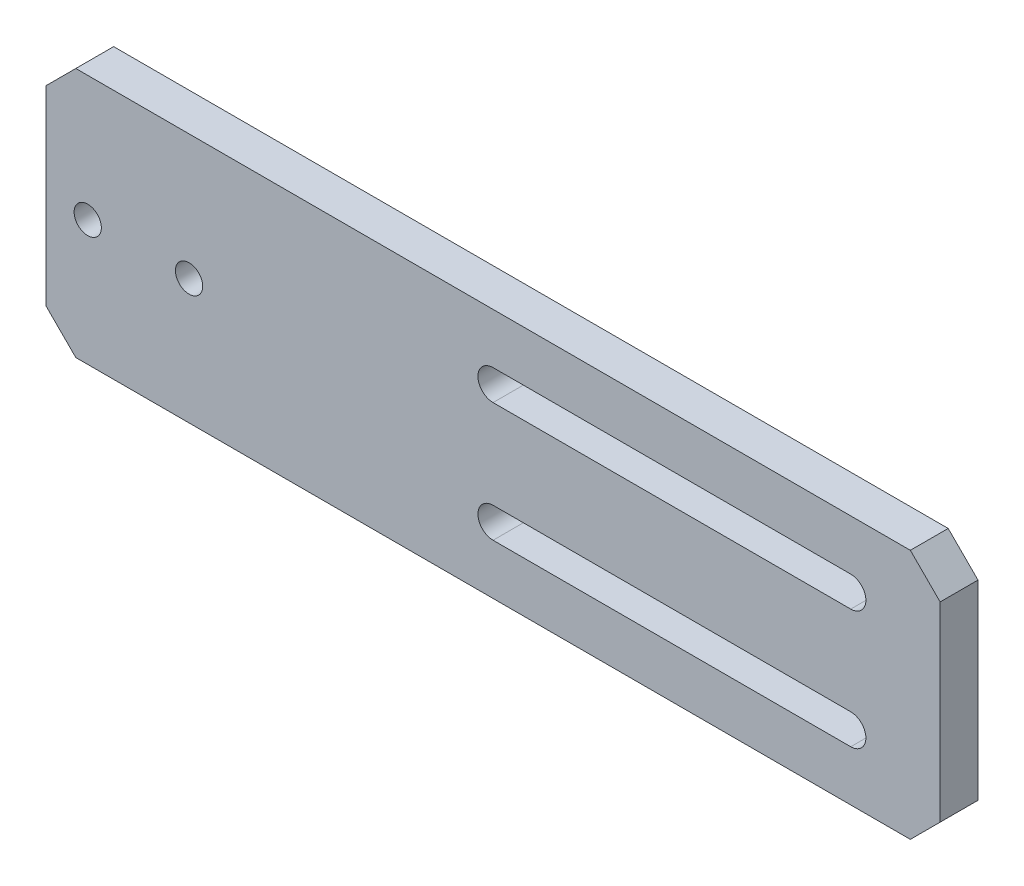
ISO-10303-21;
HEADER;
FILE_DESCRIPTION(('STEP AP214'),'2;1');
FILE_NAME('part.step','',(''),(''),'','','');
FILE_SCHEMA(('AUTOMOTIVE_DESIGN { 1 0 10303 214 1 1 1 1 }'));
ENDSEC;
DATA;
#1=APPLICATION_CONTEXT('core data for automotive mechanical design processes');
#2=APPLICATION_PROTOCOL_DEFINITION('international standard','automotive_design',2000,#1);
#3=PRODUCT_CONTEXT('',#1,'mechanical');
#4=PRODUCT('Part','Part','',(#3));
#5=PRODUCT_RELATED_PRODUCT_CATEGORY('part','',(#4));
#6=PRODUCT_DEFINITION_FORMATION('','',#4);
#7=PRODUCT_DEFINITION_CONTEXT('part definition',#1,'design');
#8=PRODUCT_DEFINITION('design','',#6,#7);
#9=PRODUCT_DEFINITION_SHAPE('','',#8);
#10=(LENGTH_UNIT() NAMED_UNIT(*) SI_UNIT(.MILLI.,.METRE.));
#11=(NAMED_UNIT(*) PLANE_ANGLE_UNIT() SI_UNIT($,.RADIAN.));
#12=(NAMED_UNIT(*) SI_UNIT($,.STERADIAN.) SOLID_ANGLE_UNIT());
#13=UNCERTAINTY_MEASURE_WITH_UNIT(LENGTH_MEASURE(1.E-05),#10,'distance_accuracy_value','');
#14=(GEOMETRIC_REPRESENTATION_CONTEXT(3) GLOBAL_UNCERTAINTY_ASSIGNED_CONTEXT((#13)) GLOBAL_UNIT_ASSIGNED_CONTEXT((#10,
#11,#12)) REPRESENTATION_CONTEXT('',''));
#15=CARTESIAN_POINT('',(0.,0.,0.));
#16=DIRECTION('',(0.,0.,1.));
#17=DIRECTION('',(1.,0.,0.));
#18=AXIS2_PLACEMENT_3D('',#15,#16,#17);
#19=CARTESIAN_POINT('',(0.,0.,6.35));
#20=DIRECTION('',(0.,0.,1.));
#21=DIRECTION('',(1.,0.,0.));
#22=AXIS2_PLACEMENT_3D('',#19,#20,#21);
#23=PLANE('',#22);
#24=DIRECTION('',(0.707106781186547,-0.707106781186548,0.));
#25=VECTOR('',#24,1.);
#26=CARTESIAN_POINT('',(33.,33.,6.35));
#27=LINE('',#26,#25);
#28=CARTESIAN_POINT('',(45.,21.,6.35));
#29=VERTEX_POINT('',#28);
#30=CARTESIAN_POINT('',(50.,16.,6.35));
#31=VERTEX_POINT('',#30);
#32=EDGE_CURVE('E158',#29,#31,#27,.T.);
#33=ORIENTED_EDGE('',*,*,#32,.F.);
#34=DIRECTION('',(-1.,0.,0.));
#35=VECTOR('',#34,1.);
#36=CARTESIAN_POINT('',(-100.,21.,6.35));
#37=LINE('',#36,#35);
#38=CARTESIAN_POINT('',(-95.,21.,6.35));
#39=VERTEX_POINT('',#38);
#40=EDGE_CURVE('E229',#29,#39,#37,.T.);
#41=ORIENTED_EDGE('',*,*,#40,.T.);
#42=DIRECTION('',(0.707106781186549,0.707106781186546,0.));
#43=VECTOR('',#42,1.);
#44=CARTESIAN_POINT('',(-57.9999999999997,58.,6.35));
#45=LINE('',#44,#43);
#46=CARTESIAN_POINT('',(-100.,16.,6.35));
#47=VERTEX_POINT('',#46);
#48=EDGE_CURVE('E257',#39,#47,#45,.F.);
#49=ORIENTED_EDGE('',*,*,#48,.T.);
#50=DIRECTION('',(0.,-1.,0.));
#51=VECTOR('',#50,1.);
#52=CARTESIAN_POINT('',(-100.,21.,6.35));
#53=LINE('',#52,#51);
#54=CARTESIAN_POINT('',(-100.,-16.,6.35));
#55=VERTEX_POINT('',#54);
#56=EDGE_CURVE('E231',#47,#55,#53,.T.);
#57=ORIENTED_EDGE('',*,*,#56,.T.);
#58=DIRECTION('',(-0.707106781186546,0.707106781186549,0.));
#59=VECTOR('',#58,1.);
#60=CARTESIAN_POINT('',(-58.0000000000003,-58.,6.35));
#61=LINE('',#60,#59);
#62=CARTESIAN_POINT('',(-95.,-21.,6.35));
#63=VERTEX_POINT('',#62);
#64=EDGE_CURVE('E255',#55,#63,#61,.F.);
#65=ORIENTED_EDGE('',*,*,#64,.T.);
#66=DIRECTION('',(1.,0.,0.));
#67=VECTOR('',#66,1.);
#68=CARTESIAN_POINT('',(-100.,-21.,6.35));
#69=LINE('',#68,#67);
#70=CARTESIAN_POINT('',(45.,-21.,6.35));
#71=VERTEX_POINT('',#70);
#72=EDGE_CURVE('E173',#63,#71,#69,.T.);
#73=ORIENTED_EDGE('',*,*,#72,.T.);
#74=DIRECTION('',(-0.707106781186547,-0.707106781186548,0.));
#75=VECTOR('',#74,1.);
#76=CARTESIAN_POINT('',(33.,-33.,6.35));
#77=LINE('',#76,#75);
#78=CARTESIAN_POINT('',(50.,-16.,6.35));
#79=VERTEX_POINT('',#78);
#80=EDGE_CURVE('E151',#79,#71,#77,.T.);
#81=ORIENTED_EDGE('',*,*,#80,.F.);
#82=DIRECTION('',(0.,-1.,0.));
#83=VECTOR('',#82,1.);
#84=CARTESIAN_POINT('',(50.,0.,6.35));
#85=LINE('',#84,#83);
#86=EDGE_CURVE('E161',#31,#79,#85,.T.);
#87=ORIENTED_EDGE('',*,*,#86,.F.);
#88=EDGE_LOOP('',(#33,#41,#49,#57,#65,#73,#81,#87));
#89=FACE_BOUND('',#88,.T.);
#90=DIRECTION('',(1.,0.,0.));
#91=VECTOR('',#90,1.);
#92=CARTESIAN_POINT('',(0.,7.46,6.35));
#93=LINE('',#92,#91);
#94=CARTESIAN_POINT('',(-25.,7.46,6.35));
#95=VERTEX_POINT('',#94);
#96=CARTESIAN_POINT('',(35.,7.46,6.35));
#97=VERTEX_POINT('',#96);
#98=EDGE_CURVE('E56',#95,#97,#93,.T.);
#99=ORIENTED_EDGE('',*,*,#98,.F.);
#100=CARTESIAN_POINT('',(-25.,10.,6.35));
#101=DIRECTION('',(0.,0.,1.));
#102=DIRECTION('',(1.,0.,0.));
#103=AXIS2_PLACEMENT_3D('',#100,#101,#102);
#104=CIRCLE('',#103,2.54);
#105=CARTESIAN_POINT('',(-25.,12.54,6.35));
#106=VERTEX_POINT('',#105);
#107=EDGE_CURVE('E207',#106,#95,#104,.T.);
#108=ORIENTED_EDGE('',*,*,#107,.F.);
#109=DIRECTION('',(1.,0.,0.));
#110=VECTOR('',#109,1.);
#111=CARTESIAN_POINT('',(0.,12.54,6.35));
#112=LINE('',#111,#110);
#113=CARTESIAN_POINT('',(35.,12.54,6.35));
#114=VERTEX_POINT('',#113);
#115=EDGE_CURVE('E204',#106,#114,#112,.T.);
#116=ORIENTED_EDGE('',*,*,#115,.T.);
#117=CARTESIAN_POINT('',(35.,10.,6.35));
#118=DIRECTION('',(0.,0.,1.));
#119=DIRECTION('',(1.,0.,0.));
#120=AXIS2_PLACEMENT_3D('',#117,#118,#119);
#121=CIRCLE('',#120,2.54);
#122=EDGE_CURVE('E201',#97,#114,#121,.T.);
#123=ORIENTED_EDGE('',*,*,#122,.F.);
#124=EDGE_LOOP('',(#99,#108,#116,#123));
#125=FACE_BOUND('',#124,.T.);
#126=CARTESIAN_POINT('',(-93.,0.,6.35));
#127=DIRECTION('',(0.,0.,1.));
#128=DIRECTION('',(1.,0.,0.));
#129=AXIS2_PLACEMENT_3D('',#126,#127,#128);
#130=CIRCLE('',#129,2.28599999999999);
#131=CARTESIAN_POINT('',(-90.714,0.,6.35));
#132=VERTEX_POINT('',#131);
#133=EDGE_CURVE('E178',#132,#132,#130,.T.);
#134=ORIENTED_EDGE('',*,*,#133,.F.);
#135=EDGE_LOOP('',(#134));
#136=FACE_BOUND('',#135,.T.);
#137=CARTESIAN_POINT('',(-76.,0.,6.35));
#138=DIRECTION('',(0.,0.,1.));
#139=DIRECTION('',(1.,0.,0.));
#140=AXIS2_PLACEMENT_3D('',#137,#138,#139);
#141=CIRCLE('',#140,2.28599999999999);
#142=CARTESIAN_POINT('',(-73.714,0.,6.35));
#143=VERTEX_POINT('',#142);
#144=EDGE_CURVE('E220',#143,#143,#141,.T.);
#145=ORIENTED_EDGE('',*,*,#144,.F.);
#146=EDGE_LOOP('',(#145));
#147=FACE_BOUND('',#146,.T.);
#148=DIRECTION('',(1.,0.,0.));
#149=VECTOR('',#148,1.);
#150=CARTESIAN_POINT('',(0.,-7.46,6.35));
#151=LINE('',#150,#149);
#152=CARTESIAN_POINT('',(-25.,-7.46,6.35));
#153=VERTEX_POINT('',#152);
#154=CARTESIAN_POINT('',(35.,-7.46,6.35));
#155=VERTEX_POINT('',#154);
#156=EDGE_CURVE('E183',#153,#155,#151,.T.);
#157=ORIENTED_EDGE('',*,*,#156,.T.);
#158=CARTESIAN_POINT('',(35.,-10.,6.35));
#159=DIRECTION('',(0.,0.,1.));
#160=DIRECTION('',(1.,0.,0.));
#161=AXIS2_PLACEMENT_3D('',#158,#159,#160);
#162=CIRCLE('',#161,2.54);
#163=CARTESIAN_POINT('',(35.,-12.54,6.35));
#164=VERTEX_POINT('',#163);
#165=EDGE_CURVE('E48',#155,#164,#162,.F.);
#166=ORIENTED_EDGE('',*,*,#165,.T.);
#167=DIRECTION('',(1.,0.,0.));
#168=VECTOR('',#167,1.);
#169=CARTESIAN_POINT('',(0.,-12.54,6.35));
#170=LINE('',#169,#168);
#171=CARTESIAN_POINT('',(-25.,-12.54,6.35));
#172=VERTEX_POINT('',#171);
#173=EDGE_CURVE('E190',#172,#164,#170,.T.);
#174=ORIENTED_EDGE('',*,*,#173,.F.);
#175=CARTESIAN_POINT('',(-25.,-10.,6.35));
#176=DIRECTION('',(0.,0.,1.));
#177=DIRECTION('',(1.,0.,0.));
#178=AXIS2_PLACEMENT_3D('',#175,#176,#177);
#179=CIRCLE('',#178,2.54);
#180=EDGE_CURVE('E187',#172,#153,#179,.F.);
#181=ORIENTED_EDGE('',*,*,#180,.T.);
#182=EDGE_LOOP('',(#157,#166,#174,#181));
#183=FACE_BOUND('',#182,.T.);
#184=ADVANCED_FACE('F33',(#89,#125,#136,#147,#183),#23,.T.);
#185=CARTESIAN_POINT('',(0.,0.,0.));
#186=DIRECTION('',(0.,0.,1.));
#187=DIRECTION('',(1.,0.,0.));
#188=AXIS2_PLACEMENT_3D('',#185,#186,#187);
#189=PLANE('',#188);
#190=DIRECTION('',(-1.,0.,0.));
#191=VECTOR('',#190,1.);
#192=CARTESIAN_POINT('',(-100.,21.,0.));
#193=LINE('',#192,#191);
#194=CARTESIAN_POINT('',(45.,21.,0.));
#195=VERTEX_POINT('',#194);
#196=CARTESIAN_POINT('',(-95.,21.,0.));
#197=VERTEX_POINT('',#196);
#198=EDGE_CURVE('E226',#195,#197,#193,.T.);
#199=ORIENTED_EDGE('',*,*,#198,.F.);
#200=DIRECTION('',(0.707106781186547,-0.707106781186548,0.));
#201=VECTOR('',#200,1.);
#202=CARTESIAN_POINT('',(33.,33.,0.));
#203=LINE('',#202,#201);
#204=CARTESIAN_POINT('',(50.,16.,0.));
#205=VERTEX_POINT('',#204);
#206=EDGE_CURVE('E11',#195,#205,#203,.T.);
#207=ORIENTED_EDGE('',*,*,#206,.T.);
#208=DIRECTION('',(0.,-1.,0.));
#209=VECTOR('',#208,1.);
#210=CARTESIAN_POINT('',(50.,0.,0.));
#211=LINE('',#210,#209);
#212=CARTESIAN_POINT('',(50.,-16.,0.));
#213=VERTEX_POINT('',#212);
#214=EDGE_CURVE('E41',#205,#213,#211,.T.);
#215=ORIENTED_EDGE('',*,*,#214,.T.);
#216=DIRECTION('',(-0.707106781186547,-0.707106781186548,0.));
#217=VECTOR('',#216,1.);
#218=CARTESIAN_POINT('',(33.,-33.,0.));
#219=LINE('',#218,#217);
#220=CARTESIAN_POINT('',(45.,-21.,0.));
#221=VERTEX_POINT('',#220);
#222=EDGE_CURVE('E154',#213,#221,#219,.T.);
#223=ORIENTED_EDGE('',*,*,#222,.T.);
#224=DIRECTION('',(1.,0.,0.));
#225=VECTOR('',#224,1.);
#226=CARTESIAN_POINT('',(-100.,-21.,0.));
#227=LINE('',#226,#225);
#228=CARTESIAN_POINT('',(-95.,-21.,0.));
#229=VERTEX_POINT('',#228);
#230=EDGE_CURVE('E232',#229,#221,#227,.T.);
#231=ORIENTED_EDGE('',*,*,#230,.F.);
#232=DIRECTION('',(0.707106781186546,-0.707106781186549,0.));
#233=VECTOR('',#232,1.);
#234=CARTESIAN_POINT('',(-95.,-21.,0.));
#235=LINE('',#234,#233);
#236=CARTESIAN_POINT('',(-100.,-16.,0.));
#237=VERTEX_POINT('',#236);
#238=EDGE_CURVE('E247',#229,#237,#235,.F.);
#239=ORIENTED_EDGE('',*,*,#238,.T.);
#240=DIRECTION('',(0.,-1.,0.));
#241=VECTOR('',#240,1.);
#242=CARTESIAN_POINT('',(-100.,21.,0.));
#243=LINE('',#242,#241);
#244=CARTESIAN_POINT('',(-100.,16.,0.));
#245=VERTEX_POINT('',#244);
#246=EDGE_CURVE('E238',#245,#237,#243,.T.);
#247=ORIENTED_EDGE('',*,*,#246,.F.);
#248=DIRECTION('',(-0.707106781186549,-0.707106781186546,0.));
#249=VECTOR('',#248,1.);
#250=CARTESIAN_POINT('',(-100.,16.,0.));
#251=LINE('',#250,#249);
#252=EDGE_CURVE('E249',#245,#197,#251,.F.);
#253=ORIENTED_EDGE('',*,*,#252,.T.);
#254=EDGE_LOOP('',(#199,#207,#215,#223,#231,#239,#247,#253));
#255=FACE_BOUND('',#254,.T.);
#256=CARTESIAN_POINT('',(-76.,0.,0.));
#257=DIRECTION('',(0.,0.,1.));
#258=DIRECTION('',(1.,0.,0.));
#259=AXIS2_PLACEMENT_3D('',#256,#257,#258);
#260=CIRCLE('',#259,2.28599999999999);
#261=CARTESIAN_POINT('',(-73.714,0.,0.));
#262=VERTEX_POINT('',#261);
#263=EDGE_CURVE('E223',#262,#262,#260,.T.);
#264=ORIENTED_EDGE('',*,*,#263,.T.);
#265=EDGE_LOOP('',(#264));
#266=FACE_BOUND('',#265,.T.);
#267=CARTESIAN_POINT('',(-93.,0.,0.));
#268=DIRECTION('',(0.,0.,1.));
#269=DIRECTION('',(1.,0.,0.));
#270=AXIS2_PLACEMENT_3D('',#267,#268,#269);
#271=CIRCLE('',#270,2.28599999999999);
#272=CARTESIAN_POINT('',(-90.714,0.,0.));
#273=VERTEX_POINT('',#272);
#274=EDGE_CURVE('E217',#273,#273,#271,.T.);
#275=ORIENTED_EDGE('',*,*,#274,.T.);
#276=EDGE_LOOP('',(#275));
#277=FACE_BOUND('',#276,.T.);
#278=CARTESIAN_POINT('',(-25.,10.,0.));
#279=DIRECTION('',(0.,0.,1.));
#280=DIRECTION('',(1.,0.,0.));
#281=AXIS2_PLACEMENT_3D('',#278,#279,#280);
#282=CIRCLE('',#281,2.54);
#283=CARTESIAN_POINT('',(-25.,12.54,0.));
#284=VERTEX_POINT('',#283);
#285=CARTESIAN_POINT('',(-25.,7.46,0.));
#286=VERTEX_POINT('',#285);
#287=EDGE_CURVE('E268',#284,#286,#282,.T.);
#288=ORIENTED_EDGE('',*,*,#287,.T.);
#289=DIRECTION('',(1.,0.,0.));
#290=VECTOR('',#289,1.);
#291=CARTESIAN_POINT('',(0.,7.46,0.));
#292=LINE('',#291,#290);
#293=CARTESIAN_POINT('',(35.,7.46,0.));
#294=VERTEX_POINT('',#293);
#295=EDGE_CURVE('E271',#286,#294,#292,.T.);
#296=ORIENTED_EDGE('',*,*,#295,.T.);
#297=CARTESIAN_POINT('',(35.,10.,0.));
#298=DIRECTION('',(0.,0.,1.));
#299=DIRECTION('',(1.,0.,0.));
#300=AXIS2_PLACEMENT_3D('',#297,#298,#299);
#301=CIRCLE('',#300,2.54);
#302=CARTESIAN_POINT('',(35.,12.54,0.));
#303=VERTEX_POINT('',#302);
#304=EDGE_CURVE('E262',#294,#303,#301,.T.);
#305=ORIENTED_EDGE('',*,*,#304,.T.);
#306=DIRECTION('',(1.,0.,0.));
#307=VECTOR('',#306,1.);
#308=CARTESIAN_POINT('',(0.,12.54,0.));
#309=LINE('',#308,#307);
#310=EDGE_CURVE('E265',#284,#303,#309,.T.);
#311=ORIENTED_EDGE('',*,*,#310,.F.);
#312=EDGE_LOOP('',(#288,#296,#305,#311));
#313=FACE_BOUND('',#312,.T.);
#314=CARTESIAN_POINT('',(35.,-10.,0.));
#315=DIRECTION('',(0.,0.,1.));
#316=DIRECTION('',(1.,0.,0.));
#317=AXIS2_PLACEMENT_3D('',#314,#315,#316);
#318=CIRCLE('',#317,2.54);
#319=CARTESIAN_POINT('',(35.,-7.46,0.));
#320=VERTEX_POINT('',#319);
#321=CARTESIAN_POINT('',(35.,-12.54,0.));
#322=VERTEX_POINT('',#321);
#323=EDGE_CURVE('E282',#320,#322,#318,.F.);
#324=ORIENTED_EDGE('',*,*,#323,.F.);
#325=DIRECTION('',(1.,0.,0.));
#326=VECTOR('',#325,1.);
#327=CARTESIAN_POINT('',(0.,-7.46,0.));
#328=LINE('',#327,#326);
#329=CARTESIAN_POINT('',(-25.,-7.46,0.));
#330=VERTEX_POINT('',#329);
#331=EDGE_CURVE('E274',#330,#320,#328,.T.);
#332=ORIENTED_EDGE('',*,*,#331,.F.);
#333=CARTESIAN_POINT('',(-25.,-10.,0.));
#334=DIRECTION('',(0.,0.,1.));
#335=DIRECTION('',(1.,0.,0.));
#336=AXIS2_PLACEMENT_3D('',#333,#334,#335);
#337=CIRCLE('',#336,2.54);
#338=CARTESIAN_POINT('',(-25.,-12.54,0.));
#339=VERTEX_POINT('',#338);
#340=EDGE_CURVE('E276',#339,#330,#337,.F.);
#341=ORIENTED_EDGE('',*,*,#340,.F.);
#342=DIRECTION('',(1.,0.,0.));
#343=VECTOR('',#342,1.);
#344=CARTESIAN_POINT('',(0.,-12.54,0.));
#345=LINE('',#344,#343);
#346=EDGE_CURVE('E279',#339,#322,#345,.T.);
#347=ORIENTED_EDGE('',*,*,#346,.T.);
#348=EDGE_LOOP('',(#324,#332,#341,#347));
#349=FACE_BOUND('',#348,.T.);
#350=ADVANCED_FACE('F286',(#255,#266,#277,#313,#349),#189,.F.);
#351=CARTESIAN_POINT('',(-100.,21.,6.35));
#352=DIRECTION('',(0.,-1.,0.));
#353=DIRECTION('',(0.,0.,-1.));
#354=AXIS2_PLACEMENT_3D('',#351,#352,#353);
#355=PLANE('',#354);
#356=ORIENTED_EDGE('',*,*,#40,.F.);
#357=DIRECTION('',(0.,0.,1.));
#358=VECTOR('',#357,1.);
#359=CARTESIAN_POINT('',(45.,21.,-3.65));
#360=LINE('',#359,#358);
#361=EDGE_CURVE('E179',#195,#29,#360,.T.);
#362=ORIENTED_EDGE('',*,*,#361,.F.);
#363=ORIENTED_EDGE('',*,*,#198,.T.);
#364=DIRECTION('',(0.,0.,1.));
#365=VECTOR('',#364,1.);
#366=CARTESIAN_POINT('',(-95.,21.,6.35));
#367=LINE('',#366,#365);
#368=EDGE_CURVE('E252',#197,#39,#367,.T.);
#369=ORIENTED_EDGE('',*,*,#368,.T.);
#370=EDGE_LOOP('',(#356,#362,#363,#369));
#371=FACE_BOUND('',#370,.T.);
#372=ADVANCED_FACE('F294',(#371),#355,.F.);
#373=CARTESIAN_POINT('',(-100.,21.,6.35));
#374=DIRECTION('',(1.,0.,0.));
#375=DIRECTION('',(0.,0.,-1.));
#376=AXIS2_PLACEMENT_3D('',#373,#374,#375);
#377=PLANE('',#376);
#378=ORIENTED_EDGE('',*,*,#56,.F.);
#379=DIRECTION('',(0.,0.,-1.));
#380=VECTOR('',#379,1.);
#381=CARTESIAN_POINT('',(-100.,16.,6.35));
#382=LINE('',#381,#380);
#383=EDGE_CURVE('E244',#47,#245,#382,.T.);
#384=ORIENTED_EDGE('',*,*,#383,.T.);
#385=ORIENTED_EDGE('',*,*,#246,.T.);
#386=DIRECTION('',(0.,0.,1.));
#387=VECTOR('',#386,1.);
#388=CARTESIAN_POINT('',(-100.,-16.,6.35));
#389=LINE('',#388,#387);
#390=EDGE_CURVE('E236',#237,#55,#389,.T.);
#391=ORIENTED_EDGE('',*,*,#390,.T.);
#392=EDGE_LOOP('',(#378,#384,#385,#391));
#393=FACE_BOUND('',#392,.T.);
#394=ADVANCED_FACE('F303',(#393),#377,.F.);
#395=CARTESIAN_POINT('',(-100.,-21.,6.35));
#396=DIRECTION('',(0.,1.,0.));
#397=DIRECTION('',(0.,0.,1.));
#398=AXIS2_PLACEMENT_3D('',#395,#396,#397);
#399=PLANE('',#398);
#400=ORIENTED_EDGE('',*,*,#230,.T.);
#401=DIRECTION('',(0.,0.,1.));
#402=VECTOR('',#401,1.);
#403=CARTESIAN_POINT('',(45.,-21.,-3.65));
#404=LINE('',#403,#402);
#405=EDGE_CURVE('E157',#221,#71,#404,.T.);
#406=ORIENTED_EDGE('',*,*,#405,.T.);
#407=ORIENTED_EDGE('',*,*,#72,.F.);
#408=DIRECTION('',(0.,0.,-1.));
#409=VECTOR('',#408,1.);
#410=CARTESIAN_POINT('',(-95.,-21.,6.35));
#411=LINE('',#410,#409);
#412=EDGE_CURVE('E259',#63,#229,#411,.T.);
#413=ORIENTED_EDGE('',*,*,#412,.T.);
#414=EDGE_LOOP('',(#400,#406,#407,#413));
#415=FACE_BOUND('',#414,.T.);
#416=ADVANCED_FACE('F309',(#415),#399,.F.);
#417=CARTESIAN_POINT('',(-76.,0.,0.));
#418=DIRECTION('',(0.,0.,1.));
#419=DIRECTION('',(1.,0.,0.));
#420=AXIS2_PLACEMENT_3D('',#417,#418,#419);
#421=CYLINDRICAL_SURFACE('',#420,2.28599999999999);
#422=ORIENTED_EDGE('',*,*,#263,.F.);
#423=EDGE_LOOP('',(#422));
#424=FACE_BOUND('',#423,.T.);
#425=ORIENTED_EDGE('',*,*,#144,.T.);
#426=EDGE_LOOP('',(#425));
#427=FACE_BOUND('',#426,.T.);
#428=ADVANCED_FACE('F311',(#424,#427),#421,.F.);
#429=CARTESIAN_POINT('',(-100.,16.,6.35));
#430=DIRECTION('',(0.707106781186546,-0.707106781186549,0.));
#431=DIRECTION('',(0.,0.,-1.));
#432=AXIS2_PLACEMENT_3D('',#429,#430,#431);
#433=PLANE('',#432);
#434=ORIENTED_EDGE('',*,*,#48,.F.);
#435=ORIENTED_EDGE('',*,*,#368,.F.);
#436=ORIENTED_EDGE('',*,*,#252,.F.);
#437=ORIENTED_EDGE('',*,*,#383,.F.);
#438=EDGE_LOOP('',(#434,#435,#436,#437));
#439=FACE_BOUND('',#438,.T.);
#440=ADVANCED_FACE('F299',(#439),#433,.F.);
#441=CARTESIAN_POINT('',(-95.,-21.,6.35));
#442=DIRECTION('',(0.707106781186549,0.707106781186545,0.));
#443=DIRECTION('',(0.,0.,-1.));
#444=AXIS2_PLACEMENT_3D('',#441,#442,#443);
#445=PLANE('',#444);
#446=ORIENTED_EDGE('',*,*,#64,.F.);
#447=ORIENTED_EDGE('',*,*,#390,.F.);
#448=ORIENTED_EDGE('',*,*,#238,.F.);
#449=ORIENTED_EDGE('',*,*,#412,.F.);
#450=EDGE_LOOP('',(#446,#447,#448,#449));
#451=FACE_BOUND('',#450,.T.);
#452=ADVANCED_FACE('F35',(#451),#445,.F.);
#453=CARTESIAN_POINT('',(-93.,0.,0.));
#454=DIRECTION('',(0.,0.,1.));
#455=DIRECTION('',(1.,0.,0.));
#456=AXIS2_PLACEMENT_3D('',#453,#454,#455);
#457=CYLINDRICAL_SURFACE('',#456,2.28599999999999);
#458=ORIENTED_EDGE('',*,*,#274,.F.);
#459=EDGE_LOOP('',(#458));
#460=FACE_BOUND('',#459,.T.);
#461=ORIENTED_EDGE('',*,*,#133,.T.);
#462=EDGE_LOOP('',(#461));
#463=FACE_BOUND('',#462,.T.);
#464=ADVANCED_FACE('F330',(#460,#463),#457,.F.);
#465=CARTESIAN_POINT('',(0.,7.46,-3.65));
#466=DIRECTION('',(0.,-1.,0.));
#467=DIRECTION('',(0.,0.,-1.));
#468=AXIS2_PLACEMENT_3D('',#465,#466,#467);
#469=PLANE('',#468);
#470=DIRECTION('',(0.,0.,1.));
#471=VECTOR('',#470,1.);
#472=CARTESIAN_POINT('',(-25.,7.46,-3.65));
#473=LINE('',#472,#471);
#474=EDGE_CURVE('E184',#286,#95,#473,.T.);
#475=ORIENTED_EDGE('',*,*,#474,.T.);
#476=ORIENTED_EDGE('',*,*,#98,.T.);
#477=DIRECTION('',(0.,0.,1.));
#478=VECTOR('',#477,1.);
#479=CARTESIAN_POINT('',(35.,7.46,-3.65));
#480=LINE('',#479,#478);
#481=EDGE_CURVE('E210',#294,#97,#480,.T.);
#482=ORIENTED_EDGE('',*,*,#481,.F.);
#483=ORIENTED_EDGE('',*,*,#295,.F.);
#484=EDGE_LOOP('',(#475,#476,#482,#483));
#485=FACE_BOUND('',#484,.T.);
#486=ADVANCED_FACE('F333',(#485),#469,.F.);
#487=CARTESIAN_POINT('',(-25.,10.,-3.65));
#488=DIRECTION('',(0.,0.,1.));
#489=DIRECTION('',(1.,0.,0.));
#490=AXIS2_PLACEMENT_3D('',#487,#488,#489);
#491=CYLINDRICAL_SURFACE('',#490,2.54);
#492=DIRECTION('',(0.,0.,1.));
#493=VECTOR('',#492,1.);
#494=CARTESIAN_POINT('',(-25.,12.54,-3.65));
#495=LINE('',#494,#493);
#496=EDGE_CURVE('E212',#284,#106,#495,.T.);
#497=ORIENTED_EDGE('',*,*,#496,.T.);
#498=ORIENTED_EDGE('',*,*,#107,.T.);
#499=ORIENTED_EDGE('',*,*,#474,.F.);
#500=ORIENTED_EDGE('',*,*,#287,.F.);
#501=EDGE_LOOP('',(#497,#498,#499,#500));
#502=FACE_BOUND('',#501,.T.);
#503=ADVANCED_FACE('F337',(#502),#491,.F.);
#504=CARTESIAN_POINT('',(0.,12.54,-3.65));
#505=DIRECTION('',(0.,-1.,0.));
#506=DIRECTION('',(0.,0.,-1.));
#507=AXIS2_PLACEMENT_3D('',#504,#505,#506);
#508=PLANE('',#507);
#509=ORIENTED_EDGE('',*,*,#310,.T.);
#510=DIRECTION('',(0.,0.,1.));
#511=VECTOR('',#510,1.);
#512=CARTESIAN_POINT('',(35.,12.54,-3.65));
#513=LINE('',#512,#511);
#514=EDGE_CURVE('E214',#303,#114,#513,.T.);
#515=ORIENTED_EDGE('',*,*,#514,.T.);
#516=ORIENTED_EDGE('',*,*,#115,.F.);
#517=ORIENTED_EDGE('',*,*,#496,.F.);
#518=EDGE_LOOP('',(#509,#515,#516,#517));
#519=FACE_BOUND('',#518,.T.);
#520=ADVANCED_FACE('F342',(#519),#508,.T.);
#521=CARTESIAN_POINT('',(35.,10.,-3.65));
#522=DIRECTION('',(0.,0.,1.));
#523=DIRECTION('',(1.,0.,0.));
#524=AXIS2_PLACEMENT_3D('',#521,#522,#523);
#525=CYLINDRICAL_SURFACE('',#524,2.54);
#526=ORIENTED_EDGE('',*,*,#481,.T.);
#527=ORIENTED_EDGE('',*,*,#122,.T.);
#528=ORIENTED_EDGE('',*,*,#514,.F.);
#529=ORIENTED_EDGE('',*,*,#304,.F.);
#530=EDGE_LOOP('',(#526,#527,#528,#529));
#531=FACE_BOUND('',#530,.T.);
#532=ADVANCED_FACE('F338',(#531),#525,.F.);
#533=CARTESIAN_POINT('',(35.,-10.,-3.65));
#534=DIRECTION('',(0.,0.,1.));
#535=DIRECTION('',(1.,0.,0.));
#536=AXIS2_PLACEMENT_3D('',#533,#534,#535);
#537=CYLINDRICAL_SURFACE('',#536,2.54);
#538=ORIENTED_EDGE('',*,*,#323,.T.);
#539=DIRECTION('',(0.,0.,1.));
#540=VECTOR('',#539,1.);
#541=CARTESIAN_POINT('',(35.,-12.54,-3.65));
#542=LINE('',#541,#540);
#543=EDGE_CURVE('E168',#322,#164,#542,.T.);
#544=ORIENTED_EDGE('',*,*,#543,.T.);
#545=ORIENTED_EDGE('',*,*,#165,.F.);
#546=DIRECTION('',(0.,0.,1.));
#547=VECTOR('',#546,1.);
#548=CARTESIAN_POINT('',(35.,-7.46,-3.65));
#549=LINE('',#548,#547);
#550=EDGE_CURVE('E193',#320,#155,#549,.T.);
#551=ORIENTED_EDGE('',*,*,#550,.F.);
#552=EDGE_LOOP('',(#538,#544,#545,#551));
#553=FACE_BOUND('',#552,.T.);
#554=ADVANCED_FACE('F341',(#553),#537,.F.);
#555=CARTESIAN_POINT('',(0.,-12.54,-3.65));
#556=DIRECTION('',(0.,-1.,0.));
#557=DIRECTION('',(0.,0.,-1.));
#558=AXIS2_PLACEMENT_3D('',#555,#556,#557);
#559=PLANE('',#558);
#560=DIRECTION('',(0.,0.,1.));
#561=VECTOR('',#560,1.);
#562=CARTESIAN_POINT('',(-25.,-12.54,-3.65));
#563=LINE('',#562,#561);
#564=EDGE_CURVE('E195',#339,#172,#563,.T.);
#565=ORIENTED_EDGE('',*,*,#564,.T.);
#566=ORIENTED_EDGE('',*,*,#173,.T.);
#567=ORIENTED_EDGE('',*,*,#543,.F.);
#568=ORIENTED_EDGE('',*,*,#346,.F.);
#569=EDGE_LOOP('',(#565,#566,#567,#568));
#570=FACE_BOUND('',#569,.T.);
#571=ADVANCED_FACE('F352',(#570),#559,.F.);
#572=CARTESIAN_POINT('',(-25.,-10.,-3.65));
#573=DIRECTION('',(0.,0.,1.));
#574=DIRECTION('',(1.,0.,0.));
#575=AXIS2_PLACEMENT_3D('',#572,#573,#574);
#576=CYLINDRICAL_SURFACE('',#575,2.54);
#577=ORIENTED_EDGE('',*,*,#340,.T.);
#578=DIRECTION('',(0.,0.,1.));
#579=VECTOR('',#578,1.);
#580=CARTESIAN_POINT('',(-25.,-7.46,-3.65));
#581=LINE('',#580,#579);
#582=EDGE_CURVE('E197',#330,#153,#581,.T.);
#583=ORIENTED_EDGE('',*,*,#582,.T.);
#584=ORIENTED_EDGE('',*,*,#180,.F.);
#585=ORIENTED_EDGE('',*,*,#564,.F.);
#586=EDGE_LOOP('',(#577,#583,#584,#585));
#587=FACE_BOUND('',#586,.T.);
#588=ADVANCED_FACE('F356',(#587),#576,.F.);
#589=CARTESIAN_POINT('',(0.,-7.46,-3.65));
#590=DIRECTION('',(0.,-1.,0.));
#591=DIRECTION('',(0.,0.,-1.));
#592=AXIS2_PLACEMENT_3D('',#589,#590,#591);
#593=PLANE('',#592);
#594=ORIENTED_EDGE('',*,*,#331,.T.);
#595=ORIENTED_EDGE('',*,*,#550,.T.);
#596=ORIENTED_EDGE('',*,*,#156,.F.);
#597=ORIENTED_EDGE('',*,*,#582,.F.);
#598=EDGE_LOOP('',(#594,#595,#596,#597));
#599=FACE_BOUND('',#598,.T.);
#600=ADVANCED_FACE('F353',(#599),#593,.T.);
#601=CARTESIAN_POINT('',(50.,0.,-3.65));
#602=DIRECTION('',(-1.,0.,0.));
#603=DIRECTION('',(0.,0.,1.));
#604=AXIS2_PLACEMENT_3D('',#601,#602,#603);
#605=PLANE('',#604);
#606=DIRECTION('',(0.,0.,1.));
#607=VECTOR('',#606,1.);
#608=CARTESIAN_POINT('',(50.,16.,-3.65));
#609=LINE('',#608,#607);
#610=EDGE_CURVE('E164',#205,#31,#609,.T.);
#611=ORIENTED_EDGE('',*,*,#610,.T.);
#612=ORIENTED_EDGE('',*,*,#86,.T.);
#613=DIRECTION('',(0.,0.,1.));
#614=VECTOR('',#613,1.);
#615=CARTESIAN_POINT('',(50.,-16.,-3.65));
#616=LINE('',#615,#614);
#617=EDGE_CURVE('E147',#213,#79,#616,.T.);
#618=ORIENTED_EDGE('',*,*,#617,.F.);
#619=ORIENTED_EDGE('',*,*,#214,.F.);
#620=EDGE_LOOP('',(#611,#612,#618,#619));
#621=FACE_BOUND('',#620,.T.);
#622=ADVANCED_FACE('F162',(#621),#605,.F.);
#623=CARTESIAN_POINT('',(33.,33.,-3.65));
#624=DIRECTION('',(-0.707106781186548,-0.707106781186547,0.));
#625=DIRECTION('',(0.707106781186547,-0.707106781186548,0.));
#626=AXIS2_PLACEMENT_3D('',#623,#624,#625);
#627=PLANE('',#626);
#628=ORIENTED_EDGE('',*,*,#361,.T.);
#629=ORIENTED_EDGE('',*,*,#32,.T.);
#630=ORIENTED_EDGE('',*,*,#610,.F.);
#631=ORIENTED_EDGE('',*,*,#206,.F.);
#632=EDGE_LOOP('',(#628,#629,#630,#631));
#633=FACE_BOUND('',#632,.T.);
#634=ADVANCED_FACE('F290',(#633),#627,.F.);
#635=CARTESIAN_POINT('',(33.,-33.,-3.65));
#636=DIRECTION('',(-0.707106781186548,0.707106781186547,0.));
#637=DIRECTION('',(-0.707106781186547,-0.707106781186548,0.));
#638=AXIS2_PLACEMENT_3D('',#635,#636,#637);
#639=PLANE('',#638);
#640=ORIENTED_EDGE('',*,*,#617,.T.);
#641=ORIENTED_EDGE('',*,*,#80,.T.);
#642=ORIENTED_EDGE('',*,*,#405,.F.);
#643=ORIENTED_EDGE('',*,*,#222,.F.);
#644=EDGE_LOOP('',(#640,#641,#642,#643));
#645=FACE_BOUND('',#644,.T.);
#646=ADVANCED_FACE('F149',(#645),#639,.F.);
#647=CLOSED_SHELL('',(#184,#350,#372,#394,#416,#428,#440,#452,#464,#486,#503,#520,#532,#554,
#571,#588,#600,#622,#634,#646));
#648=MANIFOLD_SOLID_BREP('B2',#647);
#649=ADVANCED_BREP_SHAPE_REPRESENTATION('',(#18,#648),#14);
#650=SHAPE_DEFINITION_REPRESENTATION(#9,#649);
ENDSEC;
END-ISO-10303-21;
